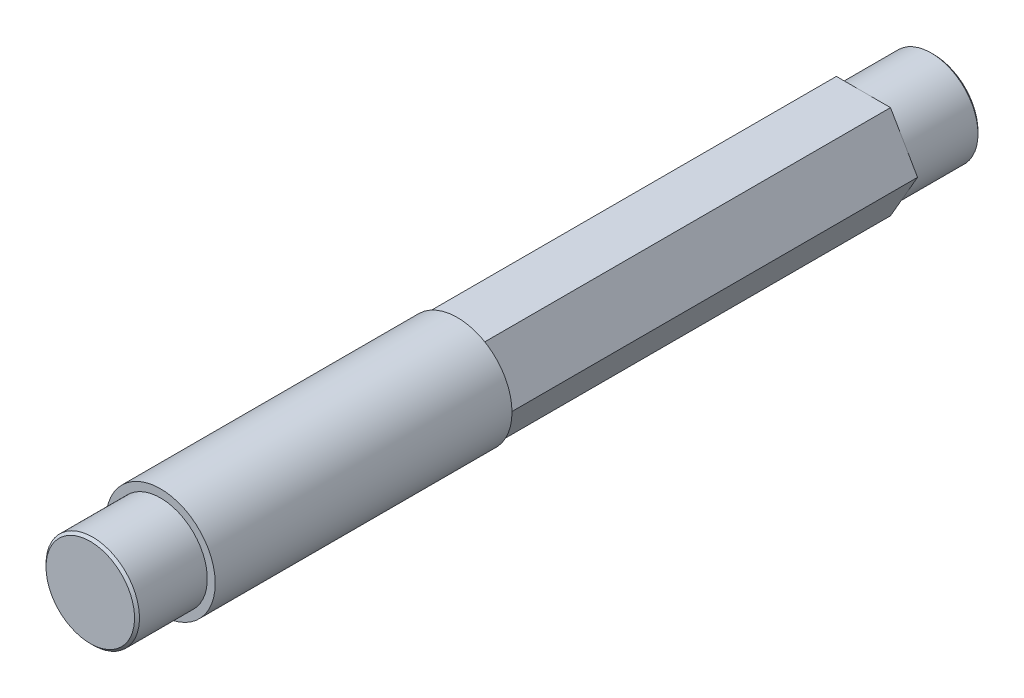
ISO-10303-21;
HEADER;
FILE_DESCRIPTION(('STEP AP214'),'2;1');
FILE_NAME('part.step','',(''),(''),'','','');
FILE_SCHEMA(('AUTOMOTIVE_DESIGN { 1 0 10303 214 1 1 1 1 }'));
ENDSEC;
DATA;
#1=APPLICATION_CONTEXT('core data for automotive mechanical design processes');
#2=APPLICATION_PROTOCOL_DEFINITION('international standard','automotive_design',2000,#1);
#3=PRODUCT_CONTEXT('',#1,'mechanical');
#4=PRODUCT('Part','Part','',(#3));
#5=PRODUCT_RELATED_PRODUCT_CATEGORY('part','',(#4));
#6=PRODUCT_DEFINITION_FORMATION('','',#4);
#7=PRODUCT_DEFINITION_CONTEXT('part definition',#1,'design');
#8=PRODUCT_DEFINITION('design','',#6,#7);
#9=PRODUCT_DEFINITION_SHAPE('','',#8);
#10=(LENGTH_UNIT() NAMED_UNIT(*) SI_UNIT(.MILLI.,.METRE.));
#11=(NAMED_UNIT(*) PLANE_ANGLE_UNIT() SI_UNIT($,.RADIAN.));
#12=(NAMED_UNIT(*) SI_UNIT($,.STERADIAN.) SOLID_ANGLE_UNIT());
#13=UNCERTAINTY_MEASURE_WITH_UNIT(LENGTH_MEASURE(1.E-05),#10,'distance_accuracy_value','');
#14=(GEOMETRIC_REPRESENTATION_CONTEXT(3) GLOBAL_UNCERTAINTY_ASSIGNED_CONTEXT((#13)) GLOBAL_UNIT_ASSIGNED_CONTEXT((#10,
#11,#12)) REPRESENTATION_CONTEXT('',''));
#15=CARTESIAN_POINT('',(0.,0.,0.));
#16=DIRECTION('',(0.,0.,1.));
#17=DIRECTION('',(1.,0.,0.));
#18=AXIS2_PLACEMENT_3D('',#15,#16,#17);
#19=CARTESIAN_POINT('',(0.,0.,-42.8625));
#20=DIRECTION('',(0.,0.,-1.));
#21=DIRECTION('',(-1.,0.,0.));
#22=AXIS2_PLACEMENT_3D('',#19,#20,#21);
#23=PLANE('',#22);
#24=CARTESIAN_POINT('',(0.,0.,-42.8625000000125));
#25=DIRECTION('',(0.,0.,1.));
#26=DIRECTION('',(1.,0.,0.));
#27=AXIS2_PLACEMENT_3D('',#24,#25,#26);
#28=CIRCLE('',#27,4.49980000001915);
#29=CARTESIAN_POINT('',(4.49980000001915,0.,-42.8625000000125));
#30=VERTEX_POINT('',#29);
#31=EDGE_CURVE('E19',#30,#30,#28,.T.);
#32=ORIENTED_EDGE('',*,*,#31,.F.);
#33=EDGE_LOOP('',(#32));
#34=FACE_BOUND('',#33,.T.);
#35=ADVANCED_FACE('F16',(#34),#23,.T.);
#36=CARTESIAN_POINT('',(0.,0.,-42.6125000000752));
#37=DIRECTION('',(0.,0.,1.));
#38=DIRECTION('',(1.,0.,0.));
#39=AXIS2_PLACEMENT_3D('',#36,#37,#38);
#40=CONICAL_SURFACE('',#39,4.74979999995639,0.785398163397448);
#41=CARTESIAN_POINT('',(0.,0.,-42.6125));
#42=DIRECTION('',(0.,0.,1.));
#43=DIRECTION('',(1.,0.,0.));
#44=AXIS2_PLACEMENT_3D('',#41,#42,#43);
#45=CIRCLE('',#44,4.7498);
#46=CARTESIAN_POINT('',(4.7498,0.,-42.6125));
#47=VERTEX_POINT('',#46);
#48=EDGE_CURVE('E101',#47,#47,#45,.T.);
#49=ORIENTED_EDGE('',*,*,#48,.F.);
#50=EDGE_LOOP('',(#49));
#51=FACE_BOUND('',#50,.T.);
#52=ORIENTED_EDGE('',*,*,#31,.T.);
#53=EDGE_LOOP('',(#52));
#54=FACE_BOUND('',#53,.T.);
#55=ADVANCED_FACE('F254',(#51,#54),#40,.T.);
#56=CARTESIAN_POINT('',(0.,0.,-42.8625));
#57=DIRECTION('',(0.,0.,1.));
#58=DIRECTION('',(1.,0.,0.));
#59=AXIS2_PLACEMENT_3D('',#56,#57,#58);
#60=CYLINDRICAL_SURFACE('',#59,4.7498);
#61=CARTESIAN_POINT('',(0.,0.,-35.71875));
#62=DIRECTION('',(0.,0.,1.));
#63=DIRECTION('',(1.,0.,0.));
#64=AXIS2_PLACEMENT_3D('',#61,#62,#63);
#65=CIRCLE('',#64,4.7498);
#66=CARTESIAN_POINT('',(4.7498,0.,-35.71875));
#67=VERTEX_POINT('',#66);
#68=EDGE_CURVE('E103',#67,#67,#65,.F.);
#69=ORIENTED_EDGE('',*,*,#68,.T.);
#70=EDGE_LOOP('',(#69));
#71=FACE_BOUND('',#70,.T.);
#72=ORIENTED_EDGE('',*,*,#48,.T.);
#73=EDGE_LOOP('',(#72));
#74=FACE_BOUND('',#73,.T.);
#75=ADVANCED_FACE('F115',(#71,#74),#60,.T.);
#76=CARTESIAN_POINT('',(0.,0.,42.8625));
#77=DIRECTION('',(0.,0.,1.));
#78=DIRECTION('',(1.,0.,0.));
#79=AXIS2_PLACEMENT_3D('',#76,#77,#78);
#80=PLANE('',#79);
#81=CARTESIAN_POINT('',(0.,0.,42.8625000000125));
#82=DIRECTION('',(0.,0.,-1.));
#83=DIRECTION('',(-1.,0.,0.));
#84=AXIS2_PLACEMENT_3D('',#81,#82,#83);
#85=CIRCLE('',#84,4.49980000001915);
#86=CARTESIAN_POINT('',(-4.49980000001915,0.,42.8625000000125));
#87=VERTEX_POINT('',#86);
#88=EDGE_CURVE('E79',#87,#87,#85,.T.);
#89=ORIENTED_EDGE('',*,*,#88,.F.);
#90=EDGE_LOOP('',(#89));
#91=FACE_BOUND('',#90,.T.);
#92=ADVANCED_FACE('F119',(#91),#80,.T.);
#93=CARTESIAN_POINT('',(0.,0.,-35.71875));
#94=DIRECTION('',(0.,0.,1.));
#95=DIRECTION('',(1.,0.,0.));
#96=AXIS2_PLACEMENT_3D('',#93,#94,#95);
#97=PLANE('',#96);
#98=DIRECTION('',(1.,0.,0.));
#99=VECTOR('',#98,1.);
#100=CARTESIAN_POINT('',(-2.7496306570156,-4.76250000000002,-35.71875));
#101=LINE('',#100,#99);
#102=CARTESIAN_POINT('',(2.74963065701558,-4.76250000000002,-35.71875));
#103=VERTEX_POINT('',#102);
#104=CARTESIAN_POINT('',(-2.7496306570156,-4.76250000000002,-35.71875));
#105=VERTEX_POINT('',#104);
#106=EDGE_CURVE('E75',#103,#105,#101,.F.);
#107=ORIENTED_EDGE('',*,*,#106,.T.);
#108=DIRECTION('',(-0.499999999999999,0.866025403784439,0.));
#109=VECTOR('',#108,1.);
#110=CARTESIAN_POINT('',(-5.49926131403121,0.,-35.71875));
#111=LINE('',#110,#109);
#112=CARTESIAN_POINT('',(-5.49926131403121,0.,-35.71875));
#113=VERTEX_POINT('',#112);
#114=EDGE_CURVE('E70',#105,#113,#111,.T.);
#115=ORIENTED_EDGE('',*,*,#114,.T.);
#116=DIRECTION('',(0.5,0.866025403784439,0.));
#117=VECTOR('',#116,1.);
#118=CARTESIAN_POINT('',(-2.7496306570156,4.76250000000003,-35.71875));
#119=LINE('',#118,#117);
#120=CARTESIAN_POINT('',(-2.7496306570156,4.76250000000003,-35.71875));
#121=VERTEX_POINT('',#120);
#122=EDGE_CURVE('E67',#113,#121,#119,.T.);
#123=ORIENTED_EDGE('',*,*,#122,.T.);
#124=DIRECTION('',(1.,0.,0.));
#125=VECTOR('',#124,1.);
#126=CARTESIAN_POINT('',(2.74963065701557,4.76250000000003,-35.71875));
#127=LINE('',#126,#125);
#128=CARTESIAN_POINT('',(2.74963065701557,4.76250000000003,-35.71875));
#129=VERTEX_POINT('',#128);
#130=EDGE_CURVE('E93',#121,#129,#127,.T.);
#131=ORIENTED_EDGE('',*,*,#130,.T.);
#132=DIRECTION('',(0.5,-0.866025403784439,0.));
#133=VECTOR('',#132,1.);
#134=CARTESIAN_POINT('',(5.49926131403118,0.,-35.71875));
#135=LINE('',#134,#133);
#136=CARTESIAN_POINT('',(5.49926131403118,0.,-35.71875));
#137=VERTEX_POINT('',#136);
#138=EDGE_CURVE('E290',#129,#137,#135,.T.);
#139=ORIENTED_EDGE('',*,*,#138,.T.);
#140=DIRECTION('',(-0.499999999999999,-0.866025403784439,0.));
#141=VECTOR('',#140,1.);
#142=CARTESIAN_POINT('',(2.74963065701558,-4.76250000000002,-35.71875));
#143=LINE('',#142,#141);
#144=EDGE_CURVE('E296',#137,#103,#143,.T.);
#145=ORIENTED_EDGE('',*,*,#144,.T.);
#146=EDGE_LOOP('',(#107,#115,#123,#131,#139,#145));
#147=FACE_BOUND('',#146,.T.);
#148=ORIENTED_EDGE('',*,*,#68,.F.);
#149=EDGE_LOOP('',(#148));
#150=FACE_BOUND('',#149,.T.);
#151=ADVANCED_FACE('F72',(#147,#150),#97,.F.);
#152=CARTESIAN_POINT('',(0.,0.,42.6125000000752));
#153=DIRECTION('',(0.,0.,-1.));
#154=DIRECTION('',(-1.,0.,0.));
#155=AXIS2_PLACEMENT_3D('',#152,#153,#154);
#156=CONICAL_SURFACE('',#155,4.74979999995639,0.785398163397448);
#157=CARTESIAN_POINT('',(0.,0.,42.6125));
#158=DIRECTION('',(0.,0.,-1.));
#159=DIRECTION('',(-1.,0.,0.));
#160=AXIS2_PLACEMENT_3D('',#157,#158,#159);
#161=CIRCLE('',#160,4.7498);
#162=CARTESIAN_POINT('',(-4.7498,0.,42.6125));
#163=VERTEX_POINT('',#162);
#164=EDGE_CURVE('E97',#163,#163,#161,.T.);
#165=ORIENTED_EDGE('',*,*,#164,.F.);
#166=EDGE_LOOP('',(#165));
#167=FACE_BOUND('',#166,.T.);
#168=ORIENTED_EDGE('',*,*,#88,.T.);
#169=EDGE_LOOP('',(#168));
#170=FACE_BOUND('',#169,.T.);
#171=ADVANCED_FACE('F118',(#167,#170),#156,.T.);
#172=CARTESIAN_POINT('',(-5.49926131403121,0.,35.71875));
#173=DIRECTION('',(0.866025403784439,0.499999999999999,0.));
#174=DIRECTION('',(-0.499999999999999,0.866025403784439,0.));
#175=AXIS2_PLACEMENT_3D('',#172,#173,#174);
#176=PLANE('',#175);
#177=DIRECTION('',(0.,0.,1.));
#178=VECTOR('',#177,1.);
#179=CARTESIAN_POINT('',(-5.49926131403121,0.,35.71875));
#180=LINE('',#179,#178);
#181=CARTESIAN_POINT('',(-5.49926131403121,0.,5.55625));
#182=VERTEX_POINT('',#181);
#183=EDGE_CURVE('E78',#182,#113,#180,.F.);
#184=ORIENTED_EDGE('',*,*,#183,.T.);
#185=ORIENTED_EDGE('',*,*,#114,.F.);
#186=DIRECTION('',(0.,0.,1.));
#187=VECTOR('',#186,1.);
#188=CARTESIAN_POINT('',(-2.7496306570156,-4.76250000000002,35.71875));
#189=LINE('',#188,#187);
#190=CARTESIAN_POINT('',(-2.7496306570156,-4.76250000000002,5.55625));
#191=VERTEX_POINT('',#190);
#192=EDGE_CURVE('E100',#105,#191,#189,.T.);
#193=ORIENTED_EDGE('',*,*,#192,.T.);
#194=DIRECTION('',(-0.5,0.866025403784439,0.));
#195=VECTOR('',#194,1.);
#196=CARTESIAN_POINT('',(-2.7496306570156,-4.76250000000002,5.55625));
#197=LINE('',#196,#195);
#198=EDGE_CURVE('E84',#191,#182,#197,.T.);
#199=ORIENTED_EDGE('',*,*,#198,.T.);
#200=EDGE_LOOP('',(#184,#185,#193,#199));
#201=FACE_BOUND('',#200,.T.);
#202=ADVANCED_FACE('F82',(#201),#176,.F.);
#203=CARTESIAN_POINT('',(-2.7496306570156,4.76250000000003,35.71875));
#204=DIRECTION('',(0.866025403784439,-0.5,0.));
#205=DIRECTION('',(0.5,0.866025403784439,0.));
#206=AXIS2_PLACEMENT_3D('',#203,#204,#205);
#207=PLANE('',#206);
#208=DIRECTION('',(0.,0.,-1.));
#209=VECTOR('',#208,1.);
#210=CARTESIAN_POINT('',(-2.7496306570156,4.76250000000003,35.71875));
#211=LINE('',#210,#209);
#212=CARTESIAN_POINT('',(-2.7496306570156,4.76250000000003,5.55625));
#213=VERTEX_POINT('',#212);
#214=EDGE_CURVE('E90',#213,#121,#211,.T.);
#215=ORIENTED_EDGE('',*,*,#214,.T.);
#216=ORIENTED_EDGE('',*,*,#122,.F.);
#217=ORIENTED_EDGE('',*,*,#183,.F.);
#218=DIRECTION('',(0.5,0.866025403784439,0.));
#219=VECTOR('',#218,1.);
#220=CARTESIAN_POINT('',(-5.49926131403121,0.,5.55625));
#221=LINE('',#220,#219);
#222=EDGE_CURVE('E305',#182,#213,#221,.T.);
#223=ORIENTED_EDGE('',*,*,#222,.T.);
#224=EDGE_LOOP('',(#215,#216,#217,#223));
#225=FACE_BOUND('',#224,.T.);
#226=ADVANCED_FACE('F88',(#225),#207,.F.);
#227=CARTESIAN_POINT('',(2.74963065701557,4.76250000000003,35.71875));
#228=DIRECTION('',(0.,-1.,0.));
#229=DIRECTION('',(0.,0.,-1.));
#230=AXIS2_PLACEMENT_3D('',#227,#228,#229);
#231=PLANE('',#230);
#232=DIRECTION('',(0.,0.,1.));
#233=VECTOR('',#232,1.);
#234=CARTESIAN_POINT('',(2.74963065701557,4.76250000000003,35.71875));
#235=LINE('',#234,#233);
#236=CARTESIAN_POINT('',(2.74963065701557,4.76250000000003,5.55625));
#237=VERTEX_POINT('',#236);
#238=EDGE_CURVE('E285',#237,#129,#235,.F.);
#239=ORIENTED_EDGE('',*,*,#238,.T.);
#240=ORIENTED_EDGE('',*,*,#130,.F.);
#241=ORIENTED_EDGE('',*,*,#214,.F.);
#242=DIRECTION('',(1.,0.,0.));
#243=VECTOR('',#242,1.);
#244=CARTESIAN_POINT('',(0.,4.76250000000003,5.55625));
#245=LINE('',#244,#243);
#246=EDGE_CURVE('E288',#213,#237,#245,.T.);
#247=ORIENTED_EDGE('',*,*,#246,.T.);
#248=EDGE_LOOP('',(#239,#240,#241,#247));
#249=FACE_BOUND('',#248,.T.);
#250=ADVANCED_FACE('F160',(#249),#231,.F.);
#251=CARTESIAN_POINT('',(5.49926131403118,0.,35.71875));
#252=DIRECTION('',(-0.866025403784439,-0.5,0.));
#253=DIRECTION('',(0.5,-0.866025403784439,0.));
#254=AXIS2_PLACEMENT_3D('',#251,#252,#253);
#255=PLANE('',#254);
#256=DIRECTION('',(0.,0.,1.));
#257=VECTOR('',#256,1.);
#258=CARTESIAN_POINT('',(5.49926131403118,0.,35.71875));
#259=LINE('',#258,#257);
#260=CARTESIAN_POINT('',(5.49926131403118,0.,5.55624999999999));
#261=VERTEX_POINT('',#260);
#262=EDGE_CURVE('E293',#261,#137,#259,.F.);
#263=ORIENTED_EDGE('',*,*,#262,.T.);
#264=ORIENTED_EDGE('',*,*,#138,.F.);
#265=ORIENTED_EDGE('',*,*,#238,.F.);
#266=DIRECTION('',(0.5,-0.866025403784439,0.));
#267=VECTOR('',#266,1.);
#268=CARTESIAN_POINT('',(2.74963065701557,4.76250000000003,5.55625));
#269=LINE('',#268,#267);
#270=EDGE_CURVE('E308',#237,#261,#269,.T.);
#271=ORIENTED_EDGE('',*,*,#270,.T.);
#272=EDGE_LOOP('',(#263,#264,#265,#271));
#273=FACE_BOUND('',#272,.T.);
#274=ADVANCED_FACE('F157',(#273),#255,.F.);
#275=CARTESIAN_POINT('',(2.74963065701558,-4.76250000000002,35.71875));
#276=DIRECTION('',(-0.866025403784439,0.499999999999999,0.));
#277=DIRECTION('',(-0.499999999999999,-0.866025403784439,0.));
#278=AXIS2_PLACEMENT_3D('',#275,#276,#277);
#279=PLANE('',#278);
#280=DIRECTION('',(0.,0.,1.));
#281=VECTOR('',#280,1.);
#282=CARTESIAN_POINT('',(2.74963065701558,-4.76250000000002,35.71875));
#283=LINE('',#282,#281);
#284=CARTESIAN_POINT('',(2.74963065701558,-4.76250000000002,5.55624999999999));
#285=VERTEX_POINT('',#284);
#286=EDGE_CURVE('E300',#285,#103,#283,.F.);
#287=ORIENTED_EDGE('',*,*,#286,.T.);
#288=ORIENTED_EDGE('',*,*,#144,.F.);
#289=ORIENTED_EDGE('',*,*,#262,.F.);
#290=DIRECTION('',(-0.499999999999999,-0.866025403784439,0.));
#291=VECTOR('',#290,1.);
#292=CARTESIAN_POINT('',(5.49926131403118,0.,5.55625));
#293=LINE('',#292,#291);
#294=EDGE_CURVE('E34',#261,#285,#293,.T.);
#295=ORIENTED_EDGE('',*,*,#294,.T.);
#296=EDGE_LOOP('',(#287,#288,#289,#295));
#297=FACE_BOUND('',#296,.T.);
#298=ADVANCED_FACE('F153',(#297),#279,.F.);
#299=CARTESIAN_POINT('',(-2.7496306570156,-4.76250000000002,35.71875));
#300=DIRECTION('',(0.,1.,0.));
#301=DIRECTION('',(0.,0.,1.));
#302=AXIS2_PLACEMENT_3D('',#299,#300,#301);
#303=PLANE('',#302);
#304=ORIENTED_EDGE('',*,*,#192,.F.);
#305=ORIENTED_EDGE('',*,*,#106,.F.);
#306=ORIENTED_EDGE('',*,*,#286,.F.);
#307=DIRECTION('',(1.,0.,0.));
#308=VECTOR('',#307,1.);
#309=CARTESIAN_POINT('',(0.,-4.76250000000002,5.55625));
#310=LINE('',#309,#308);
#311=EDGE_CURVE('E110',#285,#191,#310,.F.);
#312=ORIENTED_EDGE('',*,*,#311,.T.);
#313=EDGE_LOOP('',(#304,#305,#306,#312));
#314=FACE_BOUND('',#313,.T.);
#315=ADVANCED_FACE('F149',(#314),#303,.F.);
#316=CARTESIAN_POINT('',(0.,0.,42.8625));
#317=DIRECTION('',(0.,0.,-1.));
#318=DIRECTION('',(-1.,0.,0.));
#319=AXIS2_PLACEMENT_3D('',#316,#317,#318);
#320=CYLINDRICAL_SURFACE('',#319,4.7498);
#321=CARTESIAN_POINT('',(0.,0.,35.71875));
#322=DIRECTION('',(0.,0.,-1.));
#323=DIRECTION('',(-1.,0.,0.));
#324=AXIS2_PLACEMENT_3D('',#321,#322,#323);
#325=CIRCLE('',#324,4.7498);
#326=CARTESIAN_POINT('',(-4.7498,0.,35.71875));
#327=VERTEX_POINT('',#326);
#328=EDGE_CURVE('E107',#327,#327,#325,.T.);
#329=ORIENTED_EDGE('',*,*,#328,.F.);
#330=EDGE_LOOP('',(#329));
#331=FACE_BOUND('',#330,.T.);
#332=ORIENTED_EDGE('',*,*,#164,.T.);
#333=EDGE_LOOP('',(#332));
#334=FACE_BOUND('',#333,.T.);
#335=ADVANCED_FACE('F145',(#331,#334),#320,.T.);
#336=CARTESIAN_POINT('',(0.,0.,5.55625));
#337=DIRECTION('',(0.,0.,1.));
#338=DIRECTION('',(1.,0.,0.));
#339=AXIS2_PLACEMENT_3D('',#336,#337,#338);
#340=PLANE('',#339);
#341=ORIENTED_EDGE('',*,*,#294,.F.);
#342=ORIENTED_EDGE('',*,*,#270,.F.);
#343=ORIENTED_EDGE('',*,*,#246,.F.);
#344=ORIENTED_EDGE('',*,*,#222,.F.);
#345=ORIENTED_EDGE('',*,*,#198,.F.);
#346=ORIENTED_EDGE('',*,*,#311,.F.);
#347=EDGE_LOOP('',(#341,#342,#343,#344,#345,#346));
#348=FACE_BOUND('',#347,.T.);
#349=CARTESIAN_POINT('',(0.,0.,5.55625));
#350=DIRECTION('',(0.,0.,1.));
#351=DIRECTION('',(1.,0.,0.));
#352=AXIS2_PLACEMENT_3D('',#349,#350,#351);
#353=CIRCLE('',#352,5.55625);
#354=CARTESIAN_POINT('',(5.55625,0.,5.55625));
#355=VERTEX_POINT('',#354);
#356=EDGE_CURVE('E25',#355,#355,#353,.T.);
#357=ORIENTED_EDGE('',*,*,#356,.F.);
#358=EDGE_LOOP('',(#357));
#359=FACE_BOUND('',#358,.T.);
#360=ADVANCED_FACE('F138',(#348,#359),#340,.F.);
#361=CARTESIAN_POINT('',(0.,0.,35.71875));
#362=DIRECTION('',(0.,0.,1.));
#363=DIRECTION('',(1.,0.,0.));
#364=AXIS2_PLACEMENT_3D('',#361,#362,#363);
#365=PLANE('',#364);
#366=CARTESIAN_POINT('',(0.,0.,35.71875));
#367=DIRECTION('',(0.,0.,1.));
#368=DIRECTION('',(1.,0.,0.));
#369=AXIS2_PLACEMENT_3D('',#366,#367,#368);
#370=CIRCLE('',#369,5.55625);
#371=CARTESIAN_POINT('',(5.55625,0.,35.71875));
#372=VERTEX_POINT('',#371);
#373=EDGE_CURVE('E11',#372,#372,#370,.F.);
#374=ORIENTED_EDGE('',*,*,#373,.F.);
#375=EDGE_LOOP('',(#374));
#376=FACE_BOUND('',#375,.T.);
#377=ORIENTED_EDGE('',*,*,#328,.T.);
#378=EDGE_LOOP('',(#377));
#379=FACE_BOUND('',#378,.T.);
#380=ADVANCED_FACE('F132',(#376,#379),#365,.T.);
#381=CARTESIAN_POINT('',(0.,0.,5.55625));
#382=DIRECTION('',(0.,0.,1.));
#383=DIRECTION('',(1.,0.,0.));
#384=AXIS2_PLACEMENT_3D('',#381,#382,#383);
#385=CYLINDRICAL_SURFACE('',#384,5.55625);
#386=ORIENTED_EDGE('',*,*,#373,.T.);
#387=EDGE_LOOP('',(#386));
#388=FACE_BOUND('',#387,.T.);
#389=ORIENTED_EDGE('',*,*,#356,.T.);
#390=EDGE_LOOP('',(#389));
#391=FACE_BOUND('',#390,.T.);
#392=ADVANCED_FACE('F130',(#388,#391),#385,.T.);
#393=CLOSED_SHELL('',(#35,#55,#75,#92,#151,#171,#202,#226,#250,#274,#298,#315,#335,#360,#380,#392));
#394=MANIFOLD_SOLID_BREP('B1',#393);
#395=ADVANCED_BREP_SHAPE_REPRESENTATION('',(#18,#394),#14);
#396=SHAPE_DEFINITION_REPRESENTATION(#9,#395);
ENDSEC;
END-ISO-10303-21;
